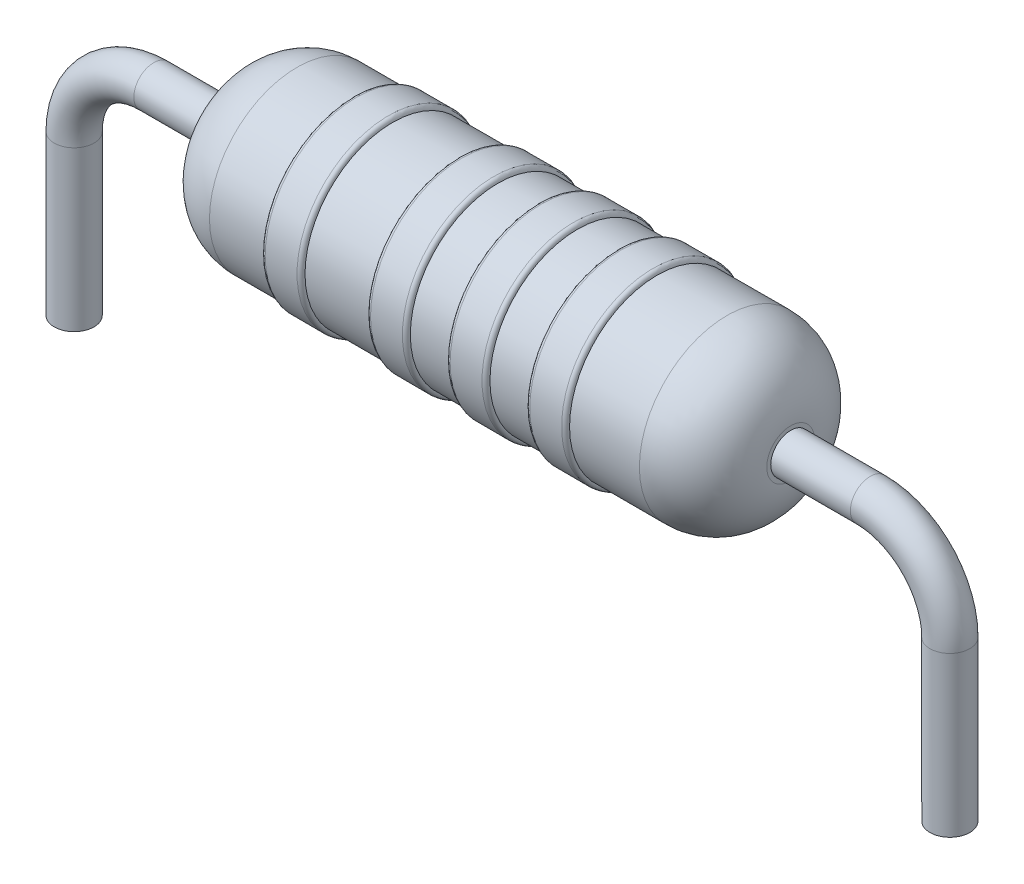
ISO-10303-21;
HEADER;
FILE_DESCRIPTION(('STEP AP214'),'2;1');
FILE_NAME('part.step','',(''),(''),'','','');
FILE_SCHEMA(('AUTOMOTIVE_DESIGN { 1 0 10303 214 1 1 1 1 }'));
ENDSEC;
DATA;
#1=APPLICATION_CONTEXT('core data for automotive mechanical design processes');
#2=APPLICATION_PROTOCOL_DEFINITION('international standard','automotive_design',2000,#1);
#3=PRODUCT_CONTEXT('',#1,'mechanical');
#4=PRODUCT('Part','Part','',(#3));
#5=PRODUCT_RELATED_PRODUCT_CATEGORY('part','',(#4));
#6=PRODUCT_DEFINITION_FORMATION('','',#4);
#7=PRODUCT_DEFINITION_CONTEXT('part definition',#1,'design');
#8=PRODUCT_DEFINITION('design','',#6,#7);
#9=PRODUCT_DEFINITION_SHAPE('','',#8);
#10=(LENGTH_UNIT() NAMED_UNIT(*) SI_UNIT(.MILLI.,.METRE.));
#11=(NAMED_UNIT(*) PLANE_ANGLE_UNIT() SI_UNIT($,.RADIAN.));
#12=(NAMED_UNIT(*) SI_UNIT($,.STERADIAN.) SOLID_ANGLE_UNIT());
#13=UNCERTAINTY_MEASURE_WITH_UNIT(LENGTH_MEASURE(1.E-05),#10,'distance_accuracy_value','');
#14=(GEOMETRIC_REPRESENTATION_CONTEXT(3) GLOBAL_UNCERTAINTY_ASSIGNED_CONTEXT((#13)) GLOBAL_UNIT_ASSIGNED_CONTEXT((#10,
#11,#12)) REPRESENTATION_CONTEXT('',''));
#15=CARTESIAN_POINT('',(0.,0.,0.));
#16=DIRECTION('',(0.,0.,1.));
#17=DIRECTION('',(1.,0.,0.));
#18=AXIS2_PLACEMENT_3D('',#15,#16,#17);
#19=CARTESIAN_POINT('',(-3.5,0.,0.));
#20=DIRECTION('',(1.,0.,0.));
#21=DIRECTION('',(0.,0.,-1.));
#22=AXIS2_PLACEMENT_3D('',#19,#20,#21);
#23=PLANE('',#22);
#24=CARTESIAN_POINT('',(-3.5,0.,0.));
#25=DIRECTION('',(-1.,0.,0.));
#26=DIRECTION('',(0.,0.,1.));
#27=AXIS2_PLACEMENT_3D('',#24,#25,#26);
#28=CIRCLE('',#27,0.299999999999995);
#29=CARTESIAN_POINT('',(-3.5,0.,0.299999999999995));
#30=VERTEX_POINT('',#29);
#31=EDGE_CURVE('E62',#30,#30,#28,.T.);
#32=ORIENTED_EDGE('',*,*,#31,.T.);
#33=EDGE_LOOP('',(#32));
#34=FACE_BOUND('',#33,.T.);
#35=CARTESIAN_POINT('',(-3.5,0.,0.));
#36=DIRECTION('',(-1.,0.,0.));
#37=DIRECTION('',(0.,0.,1.));
#38=AXIS2_PLACEMENT_3D('',#35,#36,#37);
#39=CIRCLE('',#38,0.25);
#40=CARTESIAN_POINT('',(-3.5,0.,0.25));
#41=VERTEX_POINT('',#40);
#42=EDGE_CURVE('E10',#41,#41,#39,.T.);
#43=ORIENTED_EDGE('',*,*,#42,.F.);
#44=EDGE_LOOP('',(#43));
#45=FACE_BOUND('',#44,.T.);
#46=ADVANCED_FACE('F35',(#34,#45),#23,.F.);
#47=CARTESIAN_POINT('',(-54.2686615886834,0.,0.));
#48=DIRECTION('',(-1.,0.,0.));
#49=DIRECTION('',(0.,0.,1.));
#50=AXIS2_PLACEMENT_3D('',#47,#48,#49);
#51=CYLINDRICAL_SURFACE('',#50,1.1);
#52=CARTESIAN_POINT('',(0.322975145638588,0.,0.));
#53=DIRECTION('',(-1.,0.,0.));
#54=DIRECTION('',(0.,0.,1.));
#55=AXIS2_PLACEMENT_3D('',#52,#53,#54);
#56=CIRCLE('',#55,1.1);
#57=CARTESIAN_POINT('',(0.322975145638588,0.,1.1));
#58=VERTEX_POINT('',#57);
#59=EDGE_CURVE('E82',#58,#58,#56,.T.);
#60=ORIENTED_EDGE('',*,*,#59,.T.);
#61=EDGE_LOOP('',(#60));
#62=FACE_BOUND('',#61,.T.);
#63=CARTESIAN_POINT('',(-0.177024854361413,0.,0.));
#64=DIRECTION('',(1.,0.,0.));
#65=DIRECTION('',(0.,0.,-1.));
#66=AXIS2_PLACEMENT_3D('',#63,#64,#65);
#67=CIRCLE('',#66,1.1);
#68=CARTESIAN_POINT('',(-0.177024854361413,0.,-1.1));
#69=VERTEX_POINT('',#68);
#70=EDGE_CURVE('E66',#69,#69,#67,.T.);
#71=ORIENTED_EDGE('',*,*,#70,.T.);
#72=EDGE_LOOP('',(#71));
#73=FACE_BOUND('',#72,.T.);
#74=ADVANCED_FACE('F150',(#62,#73),#51,.T.);
#75=CARTESIAN_POINT('',(4.3261723446646,0.,0.));
#76=DIRECTION('',(1.,0.,0.));
#77=DIRECTION('',(0.,0.,-1.));
#78=AXIS2_PLACEMENT_3D('',#75,#76,#77);
#79=CYLINDRICAL_SURFACE('',#78,1.15);
#80=CARTESIAN_POINT('',(-0.627024854361412,0.,0.));
#81=DIRECTION('',(-1.,0.,0.));
#82=DIRECTION('',(0.,0.,1.));
#83=AXIS2_PLACEMENT_3D('',#80,#81,#82);
#84=CIRCLE('',#83,1.15);
#85=CARTESIAN_POINT('',(-0.627024854361412,0.,1.15));
#86=VERTEX_POINT('',#85);
#87=EDGE_CURVE('E106',#86,#86,#84,.F.);
#88=ORIENTED_EDGE('',*,*,#87,.T.);
#89=EDGE_LOOP('',(#88));
#90=FACE_BOUND('',#89,.T.);
#91=CARTESIAN_POINT('',(-0.227024854361414,0.,0.));
#92=DIRECTION('',(1.,0.,0.));
#93=DIRECTION('',(0.,0.,-1.));
#94=AXIS2_PLACEMENT_3D('',#91,#92,#93);
#95=CIRCLE('',#94,1.15);
#96=CARTESIAN_POINT('',(-0.227024854361414,0.,-1.15));
#97=VERTEX_POINT('',#96);
#98=EDGE_CURVE('E103',#97,#97,#95,.F.);
#99=ORIENTED_EDGE('',*,*,#98,.T.);
#100=EDGE_LOOP('',(#99));
#101=FACE_BOUND('',#100,.T.);
#102=ADVANCED_FACE('F156',(#90,#101),#79,.T.);
#103=CARTESIAN_POINT('',(-1.5,0.,0.));
#104=DIRECTION('',(1.,0.,0.));
#105=DIRECTION('',(0.,0.,-1.));
#106=AXIS2_PLACEMENT_3D('',#103,#104,#105);
#107=CIRCLE('',#106,1.1);
#108=CARTESIAN_POINT('',(-1.5,0.,-1.1));
#109=VERTEX_POINT('',#108);
#110=EDGE_CURVE('E61',#109,#109,#107,.T.);
#111=ORIENTED_EDGE('',*,*,#110,.T.);
#112=EDGE_LOOP('',(#111));
#113=FACE_BOUND('',#112,.T.);
#114=CARTESIAN_POINT('',(-0.677024854361413,0.,0.));
#115=DIRECTION('',(-1.,0.,0.));
#116=DIRECTION('',(0.,0.,1.));
#117=AXIS2_PLACEMENT_3D('',#114,#115,#116);
#118=CIRCLE('',#117,1.1);
#119=CARTESIAN_POINT('',(-0.677024854361413,0.,1.1));
#120=VERTEX_POINT('',#119);
#121=EDGE_CURVE('E76',#120,#120,#118,.T.);
#122=ORIENTED_EDGE('',*,*,#121,.T.);
#123=EDGE_LOOP('',(#122));
#124=FACE_BOUND('',#123,.T.);
#125=ADVANCED_FACE('F158',(#113,#124),#51,.T.);
#126=CARTESIAN_POINT('',(4.3261723446646,0.,0.));
#127=DIRECTION('',(1.,0.,0.));
#128=DIRECTION('',(0.,0.,-1.));
#129=AXIS2_PLACEMENT_3D('',#126,#127,#128);
#130=CYLINDRICAL_SURFACE('',#129,1.15);
#131=CARTESIAN_POINT('',(0.372975145638589,0.,0.));
#132=DIRECTION('',(-1.,0.,0.));
#133=DIRECTION('',(0.,0.,1.));
#134=AXIS2_PLACEMENT_3D('',#131,#132,#133);
#135=CIRCLE('',#134,1.15);
#136=CARTESIAN_POINT('',(0.372975145638589,0.,1.15));
#137=VERTEX_POINT('',#136);
#138=EDGE_CURVE('E112',#137,#137,#135,.F.);
#139=ORIENTED_EDGE('',*,*,#138,.T.);
#140=EDGE_LOOP('',(#139));
#141=FACE_BOUND('',#140,.T.);
#142=CARTESIAN_POINT('',(0.772975145638587,0.,0.));
#143=DIRECTION('',(1.,0.,0.));
#144=DIRECTION('',(0.,0.,-1.));
#145=AXIS2_PLACEMENT_3D('',#142,#143,#144);
#146=CIRCLE('',#145,1.15);
#147=CARTESIAN_POINT('',(0.772975145638587,0.,-1.15));
#148=VERTEX_POINT('',#147);
#149=EDGE_CURVE('E109',#148,#148,#146,.F.);
#150=ORIENTED_EDGE('',*,*,#149,.T.);
#151=EDGE_LOOP('',(#150));
#152=FACE_BOUND('',#151,.T.);
#153=ADVANCED_FACE('F167',(#141,#152),#130,.T.);
#154=CARTESIAN_POINT('',(1.32297514563859,0.,0.));
#155=DIRECTION('',(-1.,0.,0.));
#156=DIRECTION('',(0.,0.,1.));
#157=AXIS2_PLACEMENT_3D('',#154,#155,#156);
#158=CIRCLE('',#157,1.1);
#159=CARTESIAN_POINT('',(1.32297514563859,0.,1.1));
#160=VERTEX_POINT('',#159);
#161=EDGE_CURVE('E88',#160,#160,#158,.T.);
#162=ORIENTED_EDGE('',*,*,#161,.T.);
#163=EDGE_LOOP('',(#162));
#164=FACE_BOUND('',#163,.T.);
#165=CARTESIAN_POINT('',(0.822975145638588,0.,0.));
#166=DIRECTION('',(1.,0.,0.));
#167=DIRECTION('',(0.,0.,-1.));
#168=AXIS2_PLACEMENT_3D('',#165,#166,#167);
#169=CIRCLE('',#168,1.1);
#170=CARTESIAN_POINT('',(0.822975145638588,0.,-1.1));
#171=VERTEX_POINT('',#170);
#172=EDGE_CURVE('E79',#171,#171,#169,.T.);
#173=ORIENTED_EDGE('',*,*,#172,.T.);
#174=EDGE_LOOP('',(#173));
#175=FACE_BOUND('',#174,.T.);
#176=ADVANCED_FACE('F133',(#164,#175),#51,.T.);
#177=CARTESIAN_POINT('',(4.3261723446646,0.,0.));
#178=DIRECTION('',(1.,0.,0.));
#179=DIRECTION('',(0.,0.,-1.));
#180=AXIS2_PLACEMENT_3D('',#177,#178,#179);
#181=CYLINDRICAL_SURFACE('',#180,1.15);
#182=CARTESIAN_POINT('',(1.37297514563859,0.,0.));
#183=DIRECTION('',(-1.,0.,0.));
#184=DIRECTION('',(0.,0.,1.));
#185=AXIS2_PLACEMENT_3D('',#182,#183,#184);
#186=CIRCLE('',#185,1.15);
#187=CARTESIAN_POINT('',(1.37297514563859,0.,1.15));
#188=VERTEX_POINT('',#187);
#189=EDGE_CURVE('E39',#188,#188,#186,.F.);
#190=ORIENTED_EDGE('',*,*,#189,.T.);
#191=EDGE_LOOP('',(#190));
#192=FACE_BOUND('',#191,.T.);
#193=CARTESIAN_POINT('',(1.77297514563859,0.,0.));
#194=DIRECTION('',(1.,0.,0.));
#195=DIRECTION('',(0.,0.,-1.));
#196=AXIS2_PLACEMENT_3D('',#193,#194,#195);
#197=CIRCLE('',#196,1.15);
#198=CARTESIAN_POINT('',(1.77297514563859,0.,-1.15));
#199=VERTEX_POINT('',#198);
#200=EDGE_CURVE('E47',#199,#199,#197,.F.);
#201=ORIENTED_EDGE('',*,*,#200,.T.);
#202=EDGE_LOOP('',(#201));
#203=FACE_BOUND('',#202,.T.);
#204=ADVANCED_FACE('F117',(#192,#203),#181,.T.);
#205=CARTESIAN_POINT('',(3.5,0.299999999999995,0.));
#206=DIRECTION('',(-1.,0.,0.));
#207=DIRECTION('',(0.,0.,1.));
#208=AXIS2_PLACEMENT_3D('',#205,#206,#207);
#209=PLANE('',#208);
#210=CARTESIAN_POINT('',(3.5,0.,0.));
#211=DIRECTION('',(-1.,0.,0.));
#212=DIRECTION('',(0.,0.,1.));
#213=AXIS2_PLACEMENT_3D('',#210,#211,#212);
#214=CIRCLE('',#213,0.25);
#215=CARTESIAN_POINT('',(3.5,0.,0.25));
#216=VERTEX_POINT('',#215);
#217=EDGE_CURVE('E264',#216,#216,#214,.T.);
#218=ORIENTED_EDGE('',*,*,#217,.T.);
#219=EDGE_LOOP('',(#218));
#220=FACE_BOUND('',#219,.T.);
#221=CARTESIAN_POINT('',(3.5,0.,0.));
#222=DIRECTION('',(-1.,0.,0.));
#223=DIRECTION('',(0.,0.,1.));
#224=AXIS2_PLACEMENT_3D('',#221,#222,#223);
#225=CIRCLE('',#224,0.299999999999995);
#226=CARTESIAN_POINT('',(3.5,0.,0.299999999999995));
#227=VERTEX_POINT('',#226);
#228=EDGE_CURVE('E72',#227,#227,#225,.T.);
#229=ORIENTED_EDGE('',*,*,#228,.F.);
#230=EDGE_LOOP('',(#229));
#231=FACE_BOUND('',#230,.T.);
#232=ADVANCED_FACE('F37',(#220,#231),#209,.F.);
#233=CARTESIAN_POINT('',(2.7,0.,0.));
#234=DIRECTION('',(-1.,0.,0.));
#235=DIRECTION('',(0.,0.,1.));
#236=AXIS2_PLACEMENT_3D('',#233,#234,#235);
#237=DEGENERATE_TOROIDAL_SURFACE('',#236,0.3,0.8,.T.);
#238=CARTESIAN_POINT('',(2.69999999999999,0.,0.));
#239=DIRECTION('',(-1.,0.,0.));
#240=DIRECTION('',(0.,0.,1.));
#241=AXIS2_PLACEMENT_3D('',#238,#239,#240);
#242=CIRCLE('',#241,1.1);
#243=CARTESIAN_POINT('',(2.69999999999999,0.,1.1));
#244=VERTEX_POINT('',#243);
#245=EDGE_CURVE('E69',#244,#244,#242,.T.);
#246=ORIENTED_EDGE('',*,*,#245,.F.);
#247=EDGE_LOOP('',(#246));
#248=FACE_BOUND('',#247,.T.);
#249=ORIENTED_EDGE('',*,*,#228,.T.);
#250=EDGE_LOOP('',(#249));
#251=FACE_BOUND('',#250,.T.);
#252=ADVANCED_FACE('F131',(#248,#251),#237,.T.);
#253=CARTESIAN_POINT('',(1.82297514563859,0.,0.));
#254=DIRECTION('',(1.,0.,0.));
#255=DIRECTION('',(0.,0.,-1.));
#256=AXIS2_PLACEMENT_3D('',#253,#254,#255);
#257=CIRCLE('',#256,1.1);
#258=CARTESIAN_POINT('',(1.82297514563859,0.,-1.1));
#259=VERTEX_POINT('',#258);
#260=EDGE_CURVE('E85',#259,#259,#257,.T.);
#261=ORIENTED_EDGE('',*,*,#260,.T.);
#262=EDGE_LOOP('',(#261));
#263=FACE_BOUND('',#262,.T.);
#264=ORIENTED_EDGE('',*,*,#245,.T.);
#265=EDGE_LOOP('',(#264));
#266=FACE_BOUND('',#265,.T.);
#267=ADVANCED_FACE('F127',(#263,#266),#51,.T.);
#268=CARTESIAN_POINT('',(4.3261723446646,0.,0.));
#269=DIRECTION('',(1.,0.,0.));
#270=DIRECTION('',(0.,0.,-1.));
#271=AXIS2_PLACEMENT_3D('',#268,#269,#270);
#272=CYLINDRICAL_SURFACE('',#271,1.15);
#273=CARTESIAN_POINT('',(-1.95,0.,0.));
#274=DIRECTION('',(-1.,0.,0.));
#275=DIRECTION('',(0.,0.,1.));
#276=AXIS2_PLACEMENT_3D('',#273,#274,#275);
#277=CIRCLE('',#276,1.15);
#278=CARTESIAN_POINT('',(-1.95,0.,1.15));
#279=VERTEX_POINT('',#278);
#280=EDGE_CURVE('E100',#279,#279,#277,.F.);
#281=ORIENTED_EDGE('',*,*,#280,.T.);
#282=EDGE_LOOP('',(#281));
#283=FACE_BOUND('',#282,.T.);
#284=CARTESIAN_POINT('',(-1.55,0.,0.));
#285=DIRECTION('',(1.,0.,0.));
#286=DIRECTION('',(0.,0.,-1.));
#287=AXIS2_PLACEMENT_3D('',#284,#285,#286);
#288=CIRCLE('',#287,1.15);
#289=CARTESIAN_POINT('',(-1.55,0.,-1.15));
#290=VERTEX_POINT('',#289);
#291=EDGE_CURVE('E75',#290,#290,#288,.F.);
#292=ORIENTED_EDGE('',*,*,#291,.T.);
#293=EDGE_LOOP('',(#292));
#294=FACE_BOUND('',#293,.T.);
#295=ADVANCED_FACE('F130',(#283,#294),#272,.T.);
#296=CARTESIAN_POINT('',(-2.7,0.,0.));
#297=DIRECTION('',(-1.,0.,0.));
#298=DIRECTION('',(0.,0.,1.));
#299=AXIS2_PLACEMENT_3D('',#296,#297,#298);
#300=DEGENERATE_TOROIDAL_SURFACE('',#299,0.3,0.8,.T.);
#301=ORIENTED_EDGE('',*,*,#31,.F.);
#302=EDGE_LOOP('',(#301));
#303=FACE_BOUND('',#302,.T.);
#304=CARTESIAN_POINT('',(-2.69999999999999,0.,0.));
#305=DIRECTION('',(-1.,0.,0.));
#306=DIRECTION('',(0.,0.,1.));
#307=AXIS2_PLACEMENT_3D('',#304,#305,#306);
#308=CIRCLE('',#307,1.1);
#309=CARTESIAN_POINT('',(-2.69999999999999,0.,1.1));
#310=VERTEX_POINT('',#309);
#311=EDGE_CURVE('E65',#310,#310,#308,.T.);
#312=ORIENTED_EDGE('',*,*,#311,.T.);
#313=EDGE_LOOP('',(#312));
#314=FACE_BOUND('',#313,.T.);
#315=ADVANCED_FACE('F163',(#303,#314),#300,.T.);
#316=CARTESIAN_POINT('',(-2.,0.,0.));
#317=DIRECTION('',(-1.,0.,0.));
#318=DIRECTION('',(0.,0.,1.));
#319=AXIS2_PLACEMENT_3D('',#316,#317,#318);
#320=CIRCLE('',#319,1.1);
#321=CARTESIAN_POINT('',(-2.,0.,1.1));
#322=VERTEX_POINT('',#321);
#323=EDGE_CURVE('E91',#322,#322,#320,.T.);
#324=ORIENTED_EDGE('',*,*,#323,.T.);
#325=EDGE_LOOP('',(#324));
#326=FACE_BOUND('',#325,.T.);
#327=ORIENTED_EDGE('',*,*,#311,.F.);
#328=EDGE_LOOP('',(#327));
#329=FACE_BOUND('',#328,.T.);
#330=ADVANCED_FACE('F134',(#326,#329),#51,.T.);
#331=CARTESIAN_POINT('',(-1.95,0.,0.));
#332=DIRECTION('',(-1.,0.,0.));
#333=DIRECTION('',(0.,0.,1.));
#334=AXIS2_PLACEMENT_3D('',#331,#332,#333);
#335=TOROIDAL_SURFACE('',#334,1.1,0.05);
#336=ORIENTED_EDGE('',*,*,#323,.F.);
#337=EDGE_LOOP('',(#336));
#338=FACE_BOUND('',#337,.T.);
#339=ORIENTED_EDGE('',*,*,#280,.F.);
#340=EDGE_LOOP('',(#339));
#341=FACE_BOUND('',#340,.T.);
#342=ADVANCED_FACE('F177',(#338,#341),#335,.T.);
#343=CARTESIAN_POINT('',(-1.55,0.,0.));
#344=DIRECTION('',(1.,0.,0.));
#345=DIRECTION('',(0.,0.,-1.));
#346=AXIS2_PLACEMENT_3D('',#343,#344,#345);
#347=TOROIDAL_SURFACE('',#346,1.1,0.05);
#348=ORIENTED_EDGE('',*,*,#291,.F.);
#349=EDGE_LOOP('',(#348));
#350=FACE_BOUND('',#349,.T.);
#351=ORIENTED_EDGE('',*,*,#110,.F.);
#352=EDGE_LOOP('',(#351));
#353=FACE_BOUND('',#352,.T.);
#354=ADVANCED_FACE('F182',(#350,#353),#347,.T.);
#355=CARTESIAN_POINT('',(-0.627024854361412,0.,0.));
#356=DIRECTION('',(-1.,0.,0.));
#357=DIRECTION('',(0.,0.,1.));
#358=AXIS2_PLACEMENT_3D('',#355,#356,#357);
#359=TOROIDAL_SURFACE('',#358,1.1,0.05);
#360=ORIENTED_EDGE('',*,*,#121,.F.);
#361=EDGE_LOOP('',(#360));
#362=FACE_BOUND('',#361,.T.);
#363=ORIENTED_EDGE('',*,*,#87,.F.);
#364=EDGE_LOOP('',(#363));
#365=FACE_BOUND('',#364,.T.);
#366=ADVANCED_FACE('F199',(#362,#365),#359,.T.);
#367=CARTESIAN_POINT('',(-0.227024854361414,0.,0.));
#368=DIRECTION('',(1.,0.,0.));
#369=DIRECTION('',(0.,0.,-1.));
#370=AXIS2_PLACEMENT_3D('',#367,#368,#369);
#371=TOROIDAL_SURFACE('',#370,1.1,0.05);
#372=ORIENTED_EDGE('',*,*,#98,.F.);
#373=EDGE_LOOP('',(#372));
#374=FACE_BOUND('',#373,.T.);
#375=ORIENTED_EDGE('',*,*,#70,.F.);
#376=EDGE_LOOP('',(#375));
#377=FACE_BOUND('',#376,.T.);
#378=ADVANCED_FACE('F205',(#374,#377),#371,.T.);
#379=CARTESIAN_POINT('',(0.372975145638589,0.,0.));
#380=DIRECTION('',(-1.,0.,0.));
#381=DIRECTION('',(0.,0.,1.));
#382=AXIS2_PLACEMENT_3D('',#379,#380,#381);
#383=TOROIDAL_SURFACE('',#382,1.1,0.05);
#384=ORIENTED_EDGE('',*,*,#59,.F.);
#385=EDGE_LOOP('',(#384));
#386=FACE_BOUND('',#385,.T.);
#387=ORIENTED_EDGE('',*,*,#138,.F.);
#388=EDGE_LOOP('',(#387));
#389=FACE_BOUND('',#388,.T.);
#390=ADVANCED_FACE('F211',(#386,#389),#383,.T.);
#391=CARTESIAN_POINT('',(0.772975145638587,0.,0.));
#392=DIRECTION('',(1.,0.,0.));
#393=DIRECTION('',(0.,0.,-1.));
#394=AXIS2_PLACEMENT_3D('',#391,#392,#393);
#395=TOROIDAL_SURFACE('',#394,1.1,0.05);
#396=ORIENTED_EDGE('',*,*,#149,.F.);
#397=EDGE_LOOP('',(#396));
#398=FACE_BOUND('',#397,.T.);
#399=ORIENTED_EDGE('',*,*,#172,.F.);
#400=EDGE_LOOP('',(#399));
#401=FACE_BOUND('',#400,.T.);
#402=ADVANCED_FACE('F215',(#398,#401),#395,.T.);
#403=CARTESIAN_POINT('',(1.37297514563859,0.,0.));
#404=DIRECTION('',(-1.,0.,0.));
#405=DIRECTION('',(0.,0.,1.));
#406=AXIS2_PLACEMENT_3D('',#403,#404,#405);
#407=TOROIDAL_SURFACE('',#406,1.1,0.05);
#408=ORIENTED_EDGE('',*,*,#161,.F.);
#409=EDGE_LOOP('',(#408));
#410=FACE_BOUND('',#409,.T.);
#411=ORIENTED_EDGE('',*,*,#189,.F.);
#412=EDGE_LOOP('',(#411));
#413=FACE_BOUND('',#412,.T.);
#414=ADVANCED_FACE('F123',(#410,#413),#407,.T.);
#415=CARTESIAN_POINT('',(1.77297514563859,0.,0.));
#416=DIRECTION('',(1.,0.,0.));
#417=DIRECTION('',(0.,0.,-1.));
#418=AXIS2_PLACEMENT_3D('',#415,#416,#417);
#419=TOROIDAL_SURFACE('',#418,1.1,0.05);
#420=ORIENTED_EDGE('',*,*,#200,.F.);
#421=EDGE_LOOP('',(#420));
#422=FACE_BOUND('',#421,.T.);
#423=ORIENTED_EDGE('',*,*,#260,.F.);
#424=EDGE_LOOP('',(#423));
#425=FACE_BOUND('',#424,.T.);
#426=ADVANCED_FACE('F119',(#422,#425),#419,.T.);
#427=CARTESIAN_POINT('',(-5.5,-1.00000000000001,0.));
#428=DIRECTION('',(0.,-1.,0.));
#429=DIRECTION('',(0.,0.,-1.));
#430=AXIS2_PLACEMENT_3D('',#427,#428,#429);
#431=CYLINDRICAL_SURFACE('',#430,0.25);
#432=CARTESIAN_POINT('',(-5.5,-1.00000000000001,0.));
#433=DIRECTION('',(0.,-1.,0.));
#434=DIRECTION('',(0.,0.,1.));
#435=AXIS2_PLACEMENT_3D('',#432,#433,#434);
#436=CIRCLE('',#435,0.25);
#437=CARTESIAN_POINT('',(-5.75,-1.00000000000001,0.));
#438=VERTEX_POINT('',#437);
#439=EDGE_CURVE('E55',#438,#438,#436,.T.);
#440=ORIENTED_EDGE('',*,*,#439,.T.);
#441=EDGE_LOOP('',(#440));
#442=FACE_BOUND('',#441,.T.);
#443=CARTESIAN_POINT('',(-5.5,-3.,0.));
#444=DIRECTION('',(0.,-1.,0.));
#445=DIRECTION('',(0.,0.,1.));
#446=AXIS2_PLACEMENT_3D('',#443,#444,#445);
#447=CIRCLE('',#446,0.25);
#448=CARTESIAN_POINT('',(-5.5,-3.,0.25));
#449=VERTEX_POINT('',#448);
#450=EDGE_CURVE('E58',#449,#449,#447,.T.);
#451=ORIENTED_EDGE('',*,*,#450,.F.);
#452=EDGE_LOOP('',(#451));
#453=FACE_BOUND('',#452,.T.);
#454=ADVANCED_FACE('F122',(#442,#453),#431,.T.);
#455=CARTESIAN_POINT('',(-4.5,-1.,0.));
#456=DIRECTION('',(0.,0.,1.));
#457=DIRECTION('',(1.,0.,0.));
#458=AXIS2_PLACEMENT_3D('',#455,#456,#457);
#459=TOROIDAL_SURFACE('',#458,1.,0.25);
#460=CARTESIAN_POINT('',(-4.49999999999999,0.,0.));
#461=DIRECTION('',(-1.,0.,0.));
#462=DIRECTION('',(0.,0.,1.));
#463=AXIS2_PLACEMENT_3D('',#460,#461,#462);
#464=CIRCLE('',#463,0.25);
#465=CARTESIAN_POINT('',(-4.49999999999999,0.25,0.));
#466=VERTEX_POINT('',#465);
#467=EDGE_CURVE('E52',#466,#466,#464,.T.);
#468=CARTESIAN_POINT('',(-4.5,-1.,0.));
#469=DIRECTION('',(0.,0.,1.));
#470=DIRECTION('',(1.,0.,0.));
#471=AXIS2_PLACEMENT_3D('',#468,#469,#470);
#472=CIRCLE('',#471,1.25);
#473=EDGE_CURVE('',#466,#438,#472,.T.);
#474=ORIENTED_EDGE('',*,*,#467,.T.);
#475=ORIENTED_EDGE('',*,*,#439,.F.);
#476=ORIENTED_EDGE('',*,*,#473,.T.);
#477=ORIENTED_EDGE('',*,*,#473,.F.);
#478=EDGE_LOOP('',(#474,#476,#475,#477));
#479=FACE_BOUND('',#478,.T.);
#480=ADVANCED_FACE('F225',(#479),#459,.T.);
#481=CARTESIAN_POINT('',(-4.49999999999999,0.,0.));
#482=DIRECTION('',(1.,0.,0.));
#483=DIRECTION('',(0.,0.,-1.));
#484=AXIS2_PLACEMENT_3D('',#481,#482,#483);
#485=CYLINDRICAL_SURFACE('',#484,0.25);
#486=ORIENTED_EDGE('',*,*,#467,.F.);
#487=EDGE_LOOP('',(#486));
#488=FACE_BOUND('',#487,.T.);
#489=ORIENTED_EDGE('',*,*,#42,.T.);
#490=EDGE_LOOP('',(#489));
#491=FACE_BOUND('',#490,.T.);
#492=ADVANCED_FACE('F229',(#488,#491),#485,.T.);
#493=CARTESIAN_POINT('',(-5.5,-3.,0.));
#494=DIRECTION('',(0.,-1.,0.));
#495=DIRECTION('',(0.,0.,1.));
#496=AXIS2_PLACEMENT_3D('',#493,#494,#495);
#497=PLANE('',#496);
#498=ORIENTED_EDGE('',*,*,#450,.T.);
#499=EDGE_LOOP('',(#498));
#500=FACE_BOUND('',#499,.T.);
#501=ADVANCED_FACE('F233',(#500),#497,.T.);
#502=CARTESIAN_POINT('',(5.5,-1.00000000000001,0.));
#503=DIRECTION('',(0.,-1.,0.));
#504=DIRECTION('',(0.,0.,-1.));
#505=AXIS2_PLACEMENT_3D('',#502,#503,#504);
#506=CYLINDRICAL_SURFACE('',#505,0.25);
#507=CARTESIAN_POINT('',(5.5,-1.00000000000001,0.));
#508=DIRECTION('',(0.,1.,0.));
#509=DIRECTION('',(0.,0.,1.));
#510=AXIS2_PLACEMENT_3D('',#507,#508,#509);
#511=CIRCLE('',#510,0.25);
#512=CARTESIAN_POINT('',(5.75,-1.00000000000001,0.));
#513=VERTEX_POINT('',#512);
#514=EDGE_CURVE('E258',#513,#513,#511,.T.);
#515=ORIENTED_EDGE('',*,*,#514,.F.);
#516=EDGE_LOOP('',(#515));
#517=FACE_BOUND('',#516,.T.);
#518=CARTESIAN_POINT('',(5.5,-3.,0.));
#519=DIRECTION('',(0.,1.,0.));
#520=DIRECTION('',(0.,0.,1.));
#521=AXIS2_PLACEMENT_3D('',#518,#519,#520);
#522=CIRCLE('',#521,0.25);
#523=CARTESIAN_POINT('',(5.5,-3.,0.25));
#524=VERTEX_POINT('',#523);
#525=EDGE_CURVE('E50',#524,#524,#522,.T.);
#526=ORIENTED_EDGE('',*,*,#525,.T.);
#527=EDGE_LOOP('',(#526));
#528=FACE_BOUND('',#527,.T.);
#529=ADVANCED_FACE('F237',(#517,#528),#506,.T.);
#530=CARTESIAN_POINT('',(4.5,-1.,0.));
#531=DIRECTION('',(0.,0.,-1.));
#532=DIRECTION('',(-1.,0.,0.));
#533=AXIS2_PLACEMENT_3D('',#530,#531,#532);
#534=TOROIDAL_SURFACE('',#533,1.,0.25);
#535=CARTESIAN_POINT('',(4.49999999999999,0.,0.));
#536=DIRECTION('',(-1.,0.,0.));
#537=DIRECTION('',(0.,0.,1.));
#538=AXIS2_PLACEMENT_3D('',#535,#536,#537);
#539=CIRCLE('',#538,0.25);
#540=CARTESIAN_POINT('',(4.49999999999999,0.25,0.));
#541=VERTEX_POINT('',#540);
#542=EDGE_CURVE('E260',#541,#541,#539,.T.);
#543=CARTESIAN_POINT('',(4.5,-1.,0.));
#544=DIRECTION('',(0.,0.,-1.));
#545=DIRECTION('',(-1.,0.,0.));
#546=AXIS2_PLACEMENT_3D('',#543,#544,#545);
#547=CIRCLE('',#546,1.25);
#548=EDGE_CURVE('',#541,#513,#547,.T.);
#549=ORIENTED_EDGE('',*,*,#542,.F.);
#550=ORIENTED_EDGE('',*,*,#514,.T.);
#551=ORIENTED_EDGE('',*,*,#548,.T.);
#552=ORIENTED_EDGE('',*,*,#548,.F.);
#553=EDGE_LOOP('',(#549,#551,#550,#552));
#554=FACE_BOUND('',#553,.T.);
#555=ADVANCED_FACE('F241',(#554),#534,.T.);
#556=CARTESIAN_POINT('',(4.49999999999999,0.,0.));
#557=DIRECTION('',(-1.,0.,0.));
#558=DIRECTION('',(0.,0.,1.));
#559=AXIS2_PLACEMENT_3D('',#556,#557,#558);
#560=CYLINDRICAL_SURFACE('',#559,0.25);
#561=ORIENTED_EDGE('',*,*,#542,.T.);
#562=EDGE_LOOP('',(#561));
#563=FACE_BOUND('',#562,.T.);
#564=ORIENTED_EDGE('',*,*,#217,.F.);
#565=EDGE_LOOP('',(#564));
#566=FACE_BOUND('',#565,.T.);
#567=ADVANCED_FACE('F245',(#563,#566),#560,.T.);
#568=CARTESIAN_POINT('',(5.5,-3.,0.));
#569=DIRECTION('',(0.,-1.,0.));
#570=DIRECTION('',(0.,0.,1.));
#571=AXIS2_PLACEMENT_3D('',#568,#569,#570);
#572=PLANE('',#571);
#573=ORIENTED_EDGE('',*,*,#525,.F.);
#574=EDGE_LOOP('',(#573));
#575=FACE_BOUND('',#574,.T.);
#576=ADVANCED_FACE('F249',(#575),#572,.T.);
#577=CLOSED_SHELL('',(#46,#74,#102,#125,#153,#176,#204,#232,#252,#267,#295,#315,#330,#342,#354,
#366,#378,#390,#402,#414,#426,#454,#480,#492,#501,#529,#555,#567,#576));
#578=MANIFOLD_SOLID_BREP('B2',#577);
#579=ADVANCED_BREP_SHAPE_REPRESENTATION('',(#18,#578),#14);
#580=SHAPE_DEFINITION_REPRESENTATION(#9,#579);
ENDSEC;
END-ISO-10303-21;
